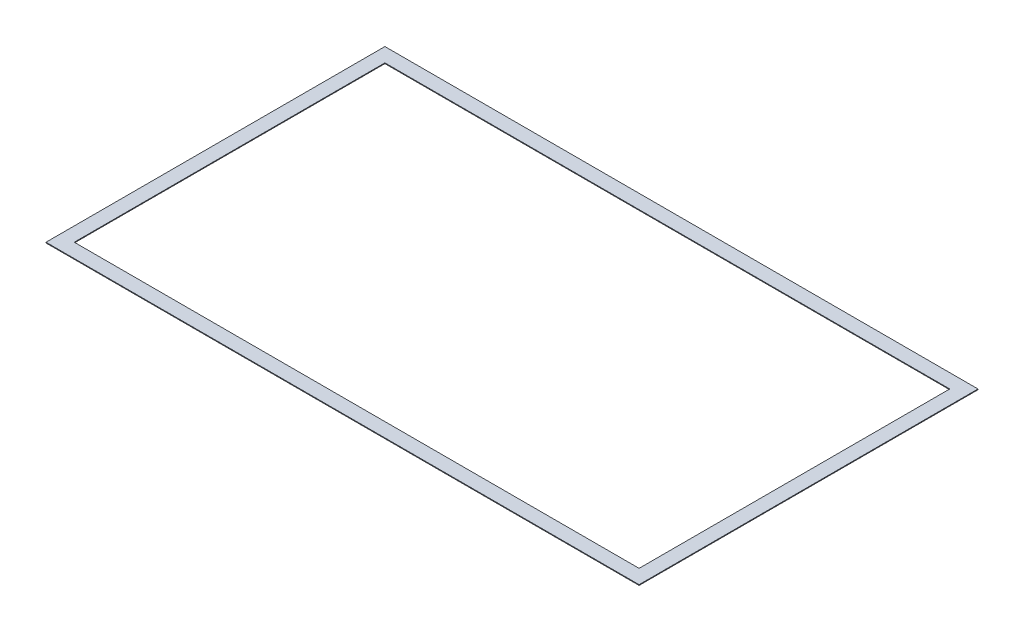
ISO-10303-21;
HEADER;
FILE_DESCRIPTION(('STEP AP214'),'2;1');
FILE_NAME('part.step','',(''),(''),'','','');
FILE_SCHEMA(('AUTOMOTIVE_DESIGN { 1 0 10303 214 1 1 1 1 }'));
ENDSEC;
DATA;
#1=APPLICATION_CONTEXT('core data for automotive mechanical design processes');
#2=APPLICATION_PROTOCOL_DEFINITION('international standard','automotive_design',2000,#1);
#3=PRODUCT_CONTEXT('',#1,'mechanical');
#4=PRODUCT('Part','Part','',(#3));
#5=PRODUCT_RELATED_PRODUCT_CATEGORY('part','',(#4));
#6=PRODUCT_DEFINITION_FORMATION('','',#4);
#7=PRODUCT_DEFINITION_CONTEXT('part definition',#1,'design');
#8=PRODUCT_DEFINITION('design','',#6,#7);
#9=PRODUCT_DEFINITION_SHAPE('','',#8);
#10=(LENGTH_UNIT() NAMED_UNIT(*) SI_UNIT(.MILLI.,.METRE.));
#11=(NAMED_UNIT(*) PLANE_ANGLE_UNIT() SI_UNIT($,.RADIAN.));
#12=(NAMED_UNIT(*) SI_UNIT($,.STERADIAN.) SOLID_ANGLE_UNIT());
#13=UNCERTAINTY_MEASURE_WITH_UNIT(LENGTH_MEASURE(1.E-05),#10,'distance_accuracy_value','');
#14=(GEOMETRIC_REPRESENTATION_CONTEXT(3) GLOBAL_UNCERTAINTY_ASSIGNED_CONTEXT((#13)) GLOBAL_UNIT_ASSIGNED_CONTEXT((#10,
#11,#12)) REPRESENTATION_CONTEXT('',''));
#15=CARTESIAN_POINT('',(0.,0.,0.));
#16=DIRECTION('',(0.,0.,1.));
#17=DIRECTION('',(1.,0.,0.));
#18=AXIS2_PLACEMENT_3D('',#15,#16,#17);
#19=CARTESIAN_POINT('',(0.,0.,0.));
#20=DIRECTION('',(0.,1.,0.));
#21=DIRECTION('',(0.,0.,1.));
#22=AXIS2_PLACEMENT_3D('',#19,#20,#21);
#23=PLANE('',#22);
#24=DIRECTION('',(1.,0.,0.));
#25=VECTOR('',#24,1.);
#26=CARTESIAN_POINT('',(1066.8,0.,-609.6));
#27=LINE('',#26,#25);
#28=CARTESIAN_POINT('',(-1066.8,0.,-609.6));
#29=VERTEX_POINT('',#28);
#30=CARTESIAN_POINT('',(1066.8,0.,-609.6));
#31=VERTEX_POINT('',#30);
#32=EDGE_CURVE('E124',#29,#31,#27,.T.);
#33=ORIENTED_EDGE('',*,*,#32,.T.);
#34=DIRECTION('',(0.,0.,1.));
#35=VECTOR('',#34,1.);
#36=CARTESIAN_POINT('',(1066.8,0.,609.6));
#37=LINE('',#36,#35);
#38=CARTESIAN_POINT('',(1066.8,0.,609.6));
#39=VERTEX_POINT('',#38);
#40=EDGE_CURVE('E117',#31,#39,#37,.T.);
#41=ORIENTED_EDGE('',*,*,#40,.T.);
#42=DIRECTION('',(-1.,0.,0.));
#43=VECTOR('',#42,1.);
#44=CARTESIAN_POINT('',(1066.8,0.,609.6));
#45=LINE('',#44,#43);
#46=CARTESIAN_POINT('',(-1066.8,0.,609.6));
#47=VERTEX_POINT('',#46);
#48=EDGE_CURVE('E112',#39,#47,#45,.T.);
#49=ORIENTED_EDGE('',*,*,#48,.T.);
#50=DIRECTION('',(0.,0.,-1.));
#51=VECTOR('',#50,1.);
#52=CARTESIAN_POINT('',(-1066.8,0.,609.6));
#53=LINE('',#52,#51);
#54=EDGE_CURVE('E108',#47,#29,#53,.T.);
#55=ORIENTED_EDGE('',*,*,#54,.T.);
#56=EDGE_LOOP('',(#33,#41,#49,#55));
#57=FACE_BOUND('',#56,.T.);
#58=DIRECTION('',(0.,0.,-1.));
#59=VECTOR('',#58,1.);
#60=CARTESIAN_POINT('',(1016.,0.,0.));
#61=LINE('',#60,#59);
#62=CARTESIAN_POINT('',(1016.,0.,558.8));
#63=VERTEX_POINT('',#62);
#64=CARTESIAN_POINT('',(1016.,0.,-558.8));
#65=VERTEX_POINT('',#64);
#66=EDGE_CURVE('E20',#63,#65,#61,.T.);
#67=ORIENTED_EDGE('',*,*,#66,.T.);
#68=DIRECTION('',(-1.,0.,0.));
#69=VECTOR('',#68,1.);
#70=CARTESIAN_POINT('',(0.,0.,-558.8));
#71=LINE('',#70,#69);
#72=CARTESIAN_POINT('',(-1016.,0.,-558.8));
#73=VERTEX_POINT('',#72);
#74=EDGE_CURVE('E104',#65,#73,#71,.T.);
#75=ORIENTED_EDGE('',*,*,#74,.T.);
#76=DIRECTION('',(0.,0.,1.));
#77=VECTOR('',#76,1.);
#78=CARTESIAN_POINT('',(-1016.,0.,0.));
#79=LINE('',#78,#77);
#80=CARTESIAN_POINT('',(-1016.,0.,558.8));
#81=VERTEX_POINT('',#80);
#82=EDGE_CURVE('E79',#73,#81,#79,.T.);
#83=ORIENTED_EDGE('',*,*,#82,.T.);
#84=DIRECTION('',(1.,0.,0.));
#85=VECTOR('',#84,1.);
#86=CARTESIAN_POINT('',(0.,0.,558.8));
#87=LINE('',#86,#85);
#88=EDGE_CURVE('E81',#81,#63,#87,.T.);
#89=ORIENTED_EDGE('',*,*,#88,.T.);
#90=EDGE_LOOP('',(#67,#75,#83,#89));
#91=FACE_BOUND('',#90,.T.);
#92=ADVANCED_FACE('F17',(#57,#91),#23,.F.);
#93=CARTESIAN_POINT('',(1016.,0.,0.));
#94=DIRECTION('',(1.,0.,0.));
#95=DIRECTION('',(0.,0.,-1.));
#96=AXIS2_PLACEMENT_3D('',#93,#94,#95);
#97=PLANE('',#96);
#98=DIRECTION('',(0.,1.,0.));
#99=VECTOR('',#98,1.);
#100=CARTESIAN_POINT('',(1016.,0.,-558.8));
#101=LINE('',#100,#99);
#102=CARTESIAN_POINT('',(1016.,2.54,-558.8));
#103=VERTEX_POINT('',#102);
#104=EDGE_CURVE('E92',#103,#65,#101,.F.);
#105=ORIENTED_EDGE('',*,*,#104,.T.);
#106=ORIENTED_EDGE('',*,*,#66,.F.);
#107=DIRECTION('',(0.,1.,0.));
#108=VECTOR('',#107,1.);
#109=CARTESIAN_POINT('',(1016.,0.,558.8));
#110=LINE('',#109,#108);
#111=CARTESIAN_POINT('',(1016.,2.54,558.8));
#112=VERTEX_POINT('',#111);
#113=EDGE_CURVE('E87',#63,#112,#110,.T.);
#114=ORIENTED_EDGE('',*,*,#113,.T.);
#115=DIRECTION('',(0.,0.,1.));
#116=VECTOR('',#115,1.);
#117=CARTESIAN_POINT('',(1016.,2.54,0.));
#118=LINE('',#117,#116);
#119=EDGE_CURVE('E127',#103,#112,#118,.T.);
#120=ORIENTED_EDGE('',*,*,#119,.F.);
#121=EDGE_LOOP('',(#105,#106,#114,#120));
#122=FACE_BOUND('',#121,.T.);
#123=ADVANCED_FACE('F89',(#122),#97,.F.);
#124=CARTESIAN_POINT('',(0.,0.,558.8));
#125=DIRECTION('',(0.,0.,1.));
#126=DIRECTION('',(1.,0.,0.));
#127=AXIS2_PLACEMENT_3D('',#124,#125,#126);
#128=PLANE('',#127);
#129=ORIENTED_EDGE('',*,*,#113,.F.);
#130=ORIENTED_EDGE('',*,*,#88,.F.);
#131=DIRECTION('',(0.,1.,0.));
#132=VECTOR('',#131,1.);
#133=CARTESIAN_POINT('',(-1016.,0.,558.8));
#134=LINE('',#133,#132);
#135=CARTESIAN_POINT('',(-1016.,2.54,558.8));
#136=VERTEX_POINT('',#135);
#137=EDGE_CURVE('E99',#81,#136,#134,.T.);
#138=ORIENTED_EDGE('',*,*,#137,.T.);
#139=DIRECTION('',(1.,0.,0.));
#140=VECTOR('',#139,1.);
#141=CARTESIAN_POINT('',(0.,2.54,558.8));
#142=LINE('',#141,#140);
#143=EDGE_CURVE('E96',#112,#136,#142,.F.);
#144=ORIENTED_EDGE('',*,*,#143,.F.);
#145=EDGE_LOOP('',(#129,#130,#138,#144));
#146=FACE_BOUND('',#145,.T.);
#147=ADVANCED_FACE('F94',(#146),#128,.F.);
#148=CARTESIAN_POINT('',(-1016.,0.,0.));
#149=DIRECTION('',(-1.,0.,0.));
#150=DIRECTION('',(0.,0.,1.));
#151=AXIS2_PLACEMENT_3D('',#148,#149,#150);
#152=PLANE('',#151);
#153=ORIENTED_EDGE('',*,*,#137,.F.);
#154=ORIENTED_EDGE('',*,*,#82,.F.);
#155=DIRECTION('',(0.,1.,0.));
#156=VECTOR('',#155,1.);
#157=CARTESIAN_POINT('',(-1016.,0.,-558.8));
#158=LINE('',#157,#156);
#159=CARTESIAN_POINT('',(-1016.,2.54,-558.8));
#160=VERTEX_POINT('',#159);
#161=EDGE_CURVE('E106',#73,#160,#158,.T.);
#162=ORIENTED_EDGE('',*,*,#161,.T.);
#163=DIRECTION('',(0.,0.,1.));
#164=VECTOR('',#163,1.);
#165=CARTESIAN_POINT('',(-1016.,2.54,0.));
#166=LINE('',#165,#164);
#167=EDGE_CURVE('E130',#136,#160,#166,.F.);
#168=ORIENTED_EDGE('',*,*,#167,.F.);
#169=EDGE_LOOP('',(#153,#154,#162,#168));
#170=FACE_BOUND('',#169,.T.);
#171=ADVANCED_FACE('F168',(#170),#152,.F.);
#172=CARTESIAN_POINT('',(0.,0.,-558.8));
#173=DIRECTION('',(0.,0.,-1.));
#174=DIRECTION('',(-1.,0.,0.));
#175=AXIS2_PLACEMENT_3D('',#172,#173,#174);
#176=PLANE('',#175);
#177=ORIENTED_EDGE('',*,*,#161,.F.);
#178=ORIENTED_EDGE('',*,*,#74,.F.);
#179=ORIENTED_EDGE('',*,*,#104,.F.);
#180=DIRECTION('',(1.,0.,0.));
#181=VECTOR('',#180,1.);
#182=CARTESIAN_POINT('',(0.,2.54,-558.8));
#183=LINE('',#182,#181);
#184=EDGE_CURVE('E133',#160,#103,#183,.T.);
#185=ORIENTED_EDGE('',*,*,#184,.F.);
#186=EDGE_LOOP('',(#177,#178,#179,#185));
#187=FACE_BOUND('',#186,.T.);
#188=ADVANCED_FACE('F160',(#187),#176,.F.);
#189=CARTESIAN_POINT('',(-1066.8,2.54,609.6));
#190=DIRECTION('',(1.,0.,0.));
#191=DIRECTION('',(0.,0.,-1.));
#192=AXIS2_PLACEMENT_3D('',#189,#190,#191);
#193=PLANE('',#192);
#194=DIRECTION('',(0.,1.,0.));
#195=VECTOR('',#194,1.);
#196=CARTESIAN_POINT('',(-1066.8,2.54,609.6));
#197=LINE('',#196,#195);
#198=CARTESIAN_POINT('',(-1066.8,2.54,609.6));
#199=VERTEX_POINT('',#198);
#200=EDGE_CURVE('E110',#47,#199,#197,.T.);
#201=ORIENTED_EDGE('',*,*,#200,.T.);
#202=DIRECTION('',(0.,0.,1.));
#203=VECTOR('',#202,1.);
#204=CARTESIAN_POINT('',(-1066.8,2.54,0.));
#205=LINE('',#204,#203);
#206=CARTESIAN_POINT('',(-1066.8,2.54,-609.6));
#207=VERTEX_POINT('',#206);
#208=EDGE_CURVE('E136',#207,#199,#205,.T.);
#209=ORIENTED_EDGE('',*,*,#208,.F.);
#210=DIRECTION('',(0.,1.,0.));
#211=VECTOR('',#210,1.);
#212=CARTESIAN_POINT('',(-1066.8,2.54,-609.6));
#213=LINE('',#212,#211);
#214=EDGE_CURVE('E121',#207,#29,#213,.F.);
#215=ORIENTED_EDGE('',*,*,#214,.T.);
#216=ORIENTED_EDGE('',*,*,#54,.F.);
#217=EDGE_LOOP('',(#201,#209,#215,#216));
#218=FACE_BOUND('',#217,.T.);
#219=ADVANCED_FACE('F158',(#218),#193,.F.);
#220=CARTESIAN_POINT('',(1066.8,2.54,609.6));
#221=DIRECTION('',(0.,0.,-1.));
#222=DIRECTION('',(-1.,0.,0.));
#223=AXIS2_PLACEMENT_3D('',#220,#221,#222);
#224=PLANE('',#223);
#225=DIRECTION('',(0.,1.,0.));
#226=VECTOR('',#225,1.);
#227=CARTESIAN_POINT('',(1066.8,2.54,609.6));
#228=LINE('',#227,#226);
#229=CARTESIAN_POINT('',(1066.8,2.54,609.6));
#230=VERTEX_POINT('',#229);
#231=EDGE_CURVE('E115',#39,#230,#228,.T.);
#232=ORIENTED_EDGE('',*,*,#231,.T.);
#233=DIRECTION('',(1.,0.,0.));
#234=VECTOR('',#233,1.);
#235=CARTESIAN_POINT('',(0.,2.54,609.6));
#236=LINE('',#235,#234);
#237=EDGE_CURVE('E139',#199,#230,#236,.T.);
#238=ORIENTED_EDGE('',*,*,#237,.F.);
#239=ORIENTED_EDGE('',*,*,#200,.F.);
#240=ORIENTED_EDGE('',*,*,#48,.F.);
#241=EDGE_LOOP('',(#232,#238,#239,#240));
#242=FACE_BOUND('',#241,.T.);
#243=ADVANCED_FACE('F150',(#242),#224,.F.);
#244=CARTESIAN_POINT('',(1066.8,2.54,609.6));
#245=DIRECTION('',(-1.,0.,0.));
#246=DIRECTION('',(0.,0.,1.));
#247=AXIS2_PLACEMENT_3D('',#244,#245,#246);
#248=PLANE('',#247);
#249=DIRECTION('',(0.,1.,0.));
#250=VECTOR('',#249,1.);
#251=CARTESIAN_POINT('',(1066.8,2.54,-609.6));
#252=LINE('',#251,#250);
#253=CARTESIAN_POINT('',(1066.8,2.54,-609.6));
#254=VERTEX_POINT('',#253);
#255=EDGE_CURVE('E35',#31,#254,#252,.T.);
#256=ORIENTED_EDGE('',*,*,#255,.T.);
#257=DIRECTION('',(0.,0.,1.));
#258=VECTOR('',#257,1.);
#259=CARTESIAN_POINT('',(1066.8,2.54,0.));
#260=LINE('',#259,#258);
#261=EDGE_CURVE('E26',#230,#254,#260,.F.);
#262=ORIENTED_EDGE('',*,*,#261,.F.);
#263=ORIENTED_EDGE('',*,*,#231,.F.);
#264=ORIENTED_EDGE('',*,*,#40,.F.);
#265=EDGE_LOOP('',(#256,#262,#263,#264));
#266=FACE_BOUND('',#265,.T.);
#267=ADVANCED_FACE('F148',(#266),#248,.F.);
#268=CARTESIAN_POINT('',(1066.8,2.54,-609.6));
#269=DIRECTION('',(0.,0.,1.));
#270=DIRECTION('',(1.,0.,0.));
#271=AXIS2_PLACEMENT_3D('',#268,#269,#270);
#272=PLANE('',#271);
#273=ORIENTED_EDGE('',*,*,#214,.F.);
#274=DIRECTION('',(1.,0.,0.));
#275=VECTOR('',#274,1.);
#276=CARTESIAN_POINT('',(0.,2.54,-609.6));
#277=LINE('',#276,#275);
#278=EDGE_CURVE('E11',#254,#207,#277,.F.);
#279=ORIENTED_EDGE('',*,*,#278,.F.);
#280=ORIENTED_EDGE('',*,*,#255,.F.);
#281=ORIENTED_EDGE('',*,*,#32,.F.);
#282=EDGE_LOOP('',(#273,#279,#280,#281));
#283=FACE_BOUND('',#282,.T.);
#284=ADVANCED_FACE('F156',(#283),#272,.F.);
#285=CARTESIAN_POINT('',(0.,2.54,0.));
#286=DIRECTION('',(0.,1.,0.));
#287=DIRECTION('',(0.,0.,1.));
#288=AXIS2_PLACEMENT_3D('',#285,#286,#287);
#289=PLANE('',#288);
#290=ORIENTED_EDGE('',*,*,#261,.T.);
#291=ORIENTED_EDGE('',*,*,#278,.T.);
#292=ORIENTED_EDGE('',*,*,#208,.T.);
#293=ORIENTED_EDGE('',*,*,#237,.T.);
#294=EDGE_LOOP('',(#290,#291,#292,#293));
#295=FACE_BOUND('',#294,.T.);
#296=ORIENTED_EDGE('',*,*,#167,.T.);
#297=ORIENTED_EDGE('',*,*,#184,.T.);
#298=ORIENTED_EDGE('',*,*,#119,.T.);
#299=ORIENTED_EDGE('',*,*,#143,.T.);
#300=EDGE_LOOP('',(#296,#297,#298,#299));
#301=FACE_BOUND('',#300,.T.);
#302=ADVANCED_FACE('F144',(#295,#301),#289,.T.);
#303=CLOSED_SHELL('',(#92,#123,#147,#171,#188,#219,#243,#267,#284,#302));
#304=MANIFOLD_SOLID_BREP('B1',#303);
#305=ADVANCED_BREP_SHAPE_REPRESENTATION('',(#18,#304),#14);
#306=SHAPE_DEFINITION_REPRESENTATION(#9,#305);
ENDSEC;
END-ISO-10303-21;
